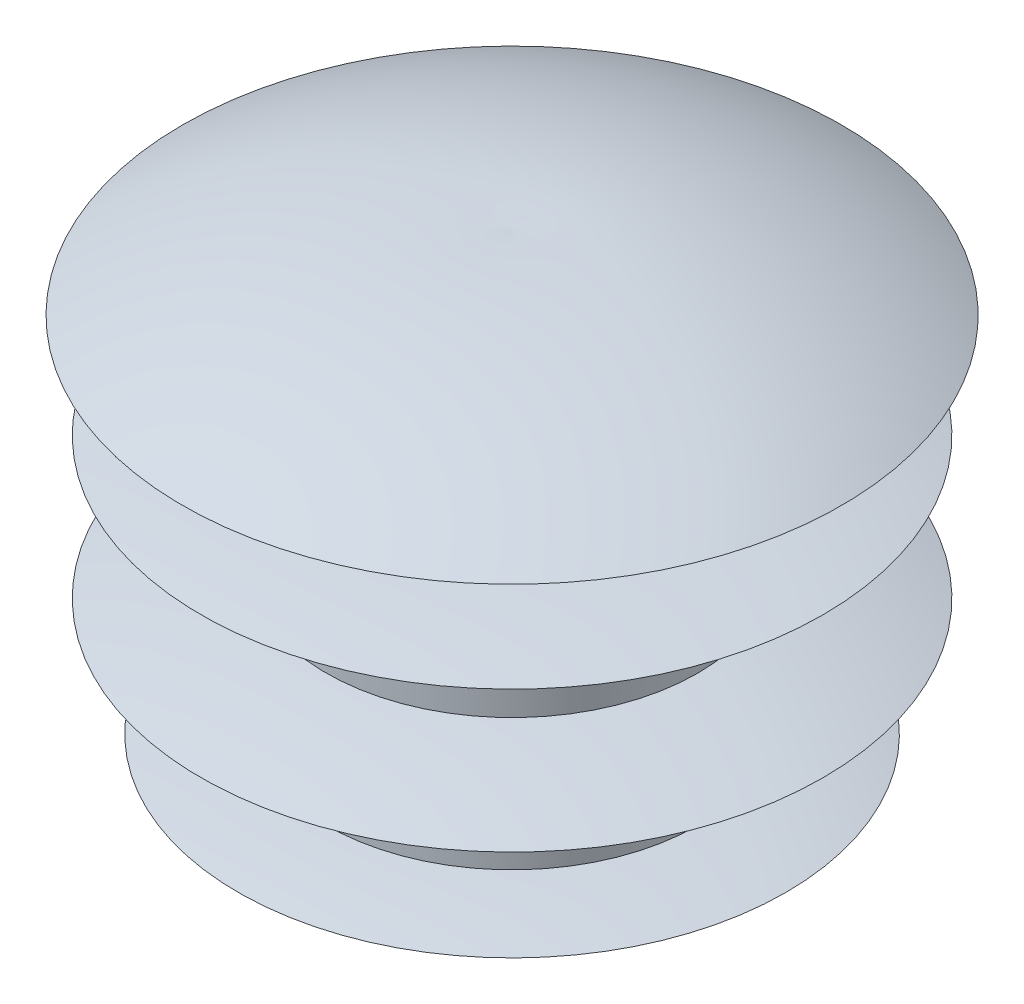
ISO-10303-21;
HEADER;
FILE_DESCRIPTION(('STEP AP214'),'2;1');
FILE_NAME('part.step','',(''),(''),'','','');
FILE_SCHEMA(('AUTOMOTIVE_DESIGN { 1 0 10303 214 1 1 1 1 }'));
ENDSEC;
DATA;
#1=APPLICATION_CONTEXT('core data for automotive mechanical design processes');
#2=APPLICATION_PROTOCOL_DEFINITION('international standard','automotive_design',2000,#1);
#3=PRODUCT_CONTEXT('',#1,'mechanical');
#4=PRODUCT('Part','Part','',(#3));
#5=PRODUCT_RELATED_PRODUCT_CATEGORY('part','',(#4));
#6=PRODUCT_DEFINITION_FORMATION('','',#4);
#7=PRODUCT_DEFINITION_CONTEXT('part definition',#1,'design');
#8=PRODUCT_DEFINITION('design','',#6,#7);
#9=PRODUCT_DEFINITION_SHAPE('','',#8);
#10=(LENGTH_UNIT() NAMED_UNIT(*) SI_UNIT(.MILLI.,.METRE.));
#11=(NAMED_UNIT(*) PLANE_ANGLE_UNIT() SI_UNIT($,.RADIAN.));
#12=(NAMED_UNIT(*) SI_UNIT($,.STERADIAN.) SOLID_ANGLE_UNIT());
#13=UNCERTAINTY_MEASURE_WITH_UNIT(LENGTH_MEASURE(1.E-05),#10,'distance_accuracy_value','');
#14=(GEOMETRIC_REPRESENTATION_CONTEXT(3) GLOBAL_UNCERTAINTY_ASSIGNED_CONTEXT((#13)) GLOBAL_UNIT_ASSIGNED_CONTEXT((#10,
#11,#12)) REPRESENTATION_CONTEXT('',''));
#15=CARTESIAN_POINT('',(0.,0.,0.));
#16=DIRECTION('',(0.,0.,1.));
#17=DIRECTION('',(1.,0.,0.));
#18=AXIS2_PLACEMENT_3D('',#15,#16,#17);
#19=CARTESIAN_POINT('',(-0.952722287189289,-16.4637011005975,0.));
#20=DIRECTION('',(0.,0.,-1.));
#21=DIRECTION('',(-1.,0.,0.));
#22=AXIS2_PLACEMENT_3D('',#19,#20,#21);
#23=CIRCLE('',#22,16.4912441521652);
#24=TRIMMED_CURVE('',#23,(PARAMETER_VALUE(-1.62859991233516)),
(PARAMETER_VALUE(1.62859991233516)),.T.,.PARAMETER.);
#25=CARTESIAN_POINT('',(0.,-16.4637011005975,0.));
#26=DIRECTION('',(0.,1.,0.));
#27=AXIS1_PLACEMENT('',#25,#26);
#28=SURFACE_OF_REVOLUTION('',#24,#27);
#29=CARTESIAN_POINT('',(0.,0.,0.));
#30=VERTEX_POINT('',#29);
#31=VERTEX_LOOP('',#30);
#32=FACE_BOUND('',#31,.T.);
#33=CARTESIAN_POINT('',(0.,-2.,0.));
#34=DIRECTION('',(0.,1.,0.));
#35=DIRECTION('',(-1.,0.,0.));
#36=AXIS2_PLACEMENT_3D('',#33,#34,#35);
#37=CIRCLE('',#36,8.875);
#38=CARTESIAN_POINT('',(-8.875,-2.00000000000001,0.));
#39=VERTEX_POINT('',#38);
#40=EDGE_CURVE('E19',#39,#39,#37,.F.);
#41=ORIENTED_EDGE('',*,*,#40,.F.);
#42=EDGE_LOOP('',(#41));
#43=FACE_BOUND('',#42,.T.);
#44=ADVANCED_FACE('F15',(#32,#43),#28,.T.);
#45=CARTESIAN_POINT('',(6.9375,-2.,0.));
#46=DIRECTION('',(0.,-1.,0.));
#47=DIRECTION('',(0.,0.,-1.));
#48=AXIS2_PLACEMENT_3D('',#45,#46,#47);
#49=PLANE('',#48);
#50=CARTESIAN_POINT('',(0.,-2.,0.));
#51=DIRECTION('',(0.,-1.,0.));
#52=DIRECTION('',(1.,0.,0.));
#53=AXIS2_PLACEMENT_3D('',#50,#51,#52);
#54=CIRCLE('',#53,5.);
#55=CARTESIAN_POINT('',(5.,-2.,0.));
#56=VERTEX_POINT('',#55);
#57=EDGE_CURVE('E34',#56,#56,#54,.T.);
#58=ORIENTED_EDGE('',*,*,#57,.F.);
#59=EDGE_LOOP('',(#58));
#60=FACE_BOUND('',#59,.T.);
#61=ORIENTED_EDGE('',*,*,#40,.T.);
#62=EDGE_LOOP('',(#61));
#63=FACE_BOUND('',#62,.T.);
#64=ADVANCED_FACE('F29',(#60,#63),#49,.T.);
#65=CARTESIAN_POINT('',(0.,-3.15,0.));
#66=DIRECTION('',(0.,-1.,0.));
#67=DIRECTION('',(1.,0.,0.));
#68=AXIS2_PLACEMENT_3D('',#65,#66,#67);
#69=CYLINDRICAL_SURFACE('',#68,5.);
#70=ORIENTED_EDGE('',*,*,#57,.T.);
#71=EDGE_LOOP('',(#70));
#72=FACE_BOUND('',#71,.T.);
#73=CARTESIAN_POINT('',(0.,-4.30000000000001,0.));
#74=DIRECTION('',(0.,-1.,0.));
#75=DIRECTION('',(0.,0.,-1.));
#76=AXIS2_PLACEMENT_3D('',#73,#74,#75);
#77=CIRCLE('',#76,5.);
#78=CARTESIAN_POINT('',(0.,-4.30000000000001,-5.));
#79=VERTEX_POINT('',#78);
#80=EDGE_CURVE('E36',#79,#79,#77,.T.);
#81=ORIENTED_EDGE('',*,*,#80,.F.);
#82=EDGE_LOOP('',(#81));
#83=FACE_BOUND('',#82,.T.);
#84=ADVANCED_FACE('F131',(#72,#83),#69,.T.);
#85=CARTESIAN_POINT('',(0.,-27.1876553346766,0.));
#86=DIRECTION('',(0.,1.,0.));
#87=DIRECTION('',(-1.,0.,0.));
#88=AXIS2_PLACEMENT_3D('',#85,#86,#87);
#89=DEGENERATE_TOROIDAL_SURFACE('',#88,3.33377328375161,22.9482260357722,.T.);
#90=ORIENTED_EDGE('',*,*,#80,.T.);
#91=EDGE_LOOP('',(#90));
#92=FACE_BOUND('',#91,.T.);
#93=CARTESIAN_POINT('',(0.,-4.8,0.));
#94=DIRECTION('',(0.,-1.,0.));
#95=DIRECTION('',(1.,0.,0.));
#96=AXIS2_PLACEMENT_3D('',#93,#94,#95);
#97=CIRCLE('',#96,8.37500000000001);
#98=CARTESIAN_POINT('',(8.37500000000001,-4.8,0.));
#99=VERTEX_POINT('',#98);
#100=EDGE_CURVE('E40',#99,#99,#97,.T.);
#101=ORIENTED_EDGE('',*,*,#100,.F.);
#102=EDGE_LOOP('',(#101));
#103=FACE_BOUND('',#102,.T.);
#104=ADVANCED_FACE('F134',(#92,#103),#89,.T.);
#105=CARTESIAN_POINT('',(0.,15.7019594484907,0.));
#106=DIRECTION('',(0.,1.,0.));
#107=DIRECTION('',(-1.,0.,0.));
#108=AXIS2_PLACEMENT_3D('',#105,#106,#107);
#109=DEGENERATE_TOROIDAL_SURFACE('',#108,2.04817567811316,21.4559792884775,.T.);
#110=ORIENTED_EDGE('',*,*,#100,.T.);
#111=EDGE_LOOP('',(#110));
#112=FACE_BOUND('',#111,.T.);
#113=CARTESIAN_POINT('',(0.,-5.55,0.));
#114=DIRECTION('',(0.,-1.,0.));
#115=DIRECTION('',(1.,0.,0.));
#116=AXIS2_PLACEMENT_3D('',#113,#114,#115);
#117=CIRCLE('',#116,5.);
#118=CARTESIAN_POINT('',(5.,-5.55,0.));
#119=VERTEX_POINT('',#118);
#120=EDGE_CURVE('E55',#119,#119,#117,.T.);
#121=ORIENTED_EDGE('',*,*,#120,.F.);
#122=EDGE_LOOP('',(#121));
#123=FACE_BOUND('',#122,.T.);
#124=ADVANCED_FACE('F129',(#112,#123),#109,.T.);
#125=CARTESIAN_POINT('',(0.,-6.7,0.));
#126=DIRECTION('',(0.,-1.,0.));
#127=DIRECTION('',(1.,0.,0.));
#128=AXIS2_PLACEMENT_3D('',#125,#126,#127);
#129=CYLINDRICAL_SURFACE('',#128,5.);
#130=ORIENTED_EDGE('',*,*,#120,.T.);
#131=EDGE_LOOP('',(#130));
#132=FACE_BOUND('',#131,.T.);
#133=CARTESIAN_POINT('',(0.,-7.85,0.));
#134=DIRECTION('',(0.,-1.,0.));
#135=DIRECTION('',(1.,0.,0.));
#136=AXIS2_PLACEMENT_3D('',#133,#134,#135);
#137=CIRCLE('',#136,5.00000000000002);
#138=CARTESIAN_POINT('',(5.00000000000002,-7.85,0.));
#139=VERTEX_POINT('',#138);
#140=EDGE_CURVE('E60',#139,#139,#137,.T.);
#141=ORIENTED_EDGE('',*,*,#140,.F.);
#142=EDGE_LOOP('',(#141));
#143=FACE_BOUND('',#142,.T.);
#144=ADVANCED_FACE('F125',(#132,#143),#129,.T.);
#145=CARTESIAN_POINT('',(0.,-29.1019594484907,0.));
#146=DIRECTION('',(0.,1.,0.));
#147=DIRECTION('',(-1.,0.,0.));
#148=AXIS2_PLACEMENT_3D('',#145,#146,#147);
#149=DEGENERATE_TOROIDAL_SURFACE('',#148,2.04817567811318,21.4559792884775,.T.);
#150=ORIENTED_EDGE('',*,*,#140,.T.);
#151=EDGE_LOOP('',(#150));
#152=FACE_BOUND('',#151,.T.);
#153=CARTESIAN_POINT('',(0.,-8.59999999999999,0.));
#154=DIRECTION('',(0.,-1.,0.));
#155=DIRECTION('',(1.,0.,0.));
#156=AXIS2_PLACEMENT_3D('',#153,#154,#155);
#157=CIRCLE('',#156,8.37499999999998);
#158=CARTESIAN_POINT('',(8.37499999999998,-8.59999999999999,0.));
#159=VERTEX_POINT('',#158);
#160=EDGE_CURVE('E65',#159,#159,#157,.T.);
#161=ORIENTED_EDGE('',*,*,#160,.F.);
#162=EDGE_LOOP('',(#161));
#163=FACE_BOUND('',#162,.T.);
#164=ADVANCED_FACE('F128',(#152,#163),#149,.T.);
#165=CARTESIAN_POINT('',(0.,13.7876553346766,0.));
#166=DIRECTION('',(0.,1.,0.));
#167=DIRECTION('',(-1.,0.,0.));
#168=AXIS2_PLACEMENT_3D('',#165,#166,#167);
#169=DEGENERATE_TOROIDAL_SURFACE('',#168,3.33377328375161,22.9482260357722,.T.);
#170=ORIENTED_EDGE('',*,*,#160,.T.);
#171=EDGE_LOOP('',(#170));
#172=FACE_BOUND('',#171,.T.);
#173=CARTESIAN_POINT('',(0.,-9.1,0.));
#174=DIRECTION('',(0.,-1.,0.));
#175=DIRECTION('',(1.,0.,0.));
#176=AXIS2_PLACEMENT_3D('',#173,#174,#175);
#177=CIRCLE('',#176,5.);
#178=CARTESIAN_POINT('',(5.,-9.1,0.));
#179=VERTEX_POINT('',#178);
#180=EDGE_CURVE('E70',#179,#179,#177,.T.);
#181=ORIENTED_EDGE('',*,*,#180,.F.);
#182=EDGE_LOOP('',(#181));
#183=FACE_BOUND('',#182,.T.);
#184=ADVANCED_FACE('F123',(#172,#183),#169,.T.);
#185=CARTESIAN_POINT('',(0.,-10.25,0.));
#186=DIRECTION('',(0.,-1.,0.));
#187=DIRECTION('',(1.,0.,0.));
#188=AXIS2_PLACEMENT_3D('',#185,#186,#187);
#189=CYLINDRICAL_SURFACE('',#188,5.);
#190=ORIENTED_EDGE('',*,*,#180,.T.);
#191=EDGE_LOOP('',(#190));
#192=FACE_BOUND('',#191,.T.);
#193=CARTESIAN_POINT('',(0.,-11.4,0.));
#194=DIRECTION('',(0.,-1.,0.));
#195=DIRECTION('',(1.,0.,0.));
#196=AXIS2_PLACEMENT_3D('',#193,#194,#195);
#197=CIRCLE('',#196,5.00000000000002);
#198=CARTESIAN_POINT('',(5.00000000000002,-11.4,0.));
#199=VERTEX_POINT('',#198);
#200=EDGE_CURVE('E75',#199,#199,#197,.T.);
#201=ORIENTED_EDGE('',*,*,#200,.F.);
#202=EDGE_LOOP('',(#201));
#203=FACE_BOUND('',#202,.T.);
#204=ADVANCED_FACE('F103',(#192,#203),#189,.T.);
#205=CARTESIAN_POINT('',(0.,-29.2836529544734,0.));
#206=DIRECTION('',(0.,1.,0.));
#207=DIRECTION('',(-1.,0.,0.));
#208=AXIS2_PLACEMENT_3D('',#205,#206,#207);
#209=DEGENERATE_TOROIDAL_SURFACE('',#208,3.39337058613575,17.9556760126023,.T.);
#210=ORIENTED_EDGE('',*,*,#200,.T.);
#211=EDGE_LOOP('',(#210));
#212=FACE_BOUND('',#211,.T.);
#213=CARTESIAN_POINT('',(0.,-11.775,0.));
#214=DIRECTION('',(0.,-1.,0.));
#215=DIRECTION('',(1.,0.,0.));
#216=AXIS2_PLACEMENT_3D('',#213,#214,#215);
#217=CIRCLE('',#216,7.375);
#218=CARTESIAN_POINT('',(7.375,-11.775,0.));
#219=VERTEX_POINT('',#218);
#220=EDGE_CURVE('E80',#219,#219,#217,.T.);
#221=ORIENTED_EDGE('',*,*,#220,.F.);
#222=EDGE_LOOP('',(#221));
#223=FACE_BOUND('',#222,.T.);
#224=ADVANCED_FACE('F94',(#212,#223),#209,.T.);
#225=CARTESIAN_POINT('',(0.,9.19487891317613,0.));
#226=DIRECTION('',(0.,1.,0.));
#227=DIRECTION('',(-1.,0.,0.));
#228=AXIS2_PLACEMENT_3D('',#225,#226,#227);
#229=DEGENERATE_TOROIDAL_SURFACE('',#228,0.586873970216786,22.0411995279179,.T.);
#230=ORIENTED_EDGE('',*,*,#220,.T.);
#231=EDGE_LOOP('',(#230));
#232=FACE_BOUND('',#231,.T.);
#233=CARTESIAN_POINT('',(0.,-12.4,0.));
#234=DIRECTION('',(0.,-1.,0.));
#235=DIRECTION('',(1.,0.,0.));
#236=AXIS2_PLACEMENT_3D('',#233,#234,#235);
#237=CIRCLE('',#236,5.);
#238=CARTESIAN_POINT('',(5.,-12.4,0.));
#239=VERTEX_POINT('',#238);
#240=EDGE_CURVE('E46',#239,#239,#237,.T.);
#241=ORIENTED_EDGE('',*,*,#240,.F.);
#242=EDGE_LOOP('',(#241));
#243=FACE_BOUND('',#242,.T.);
#244=ADVANCED_FACE('F17',(#232,#243),#229,.T.);
#245=CARTESIAN_POINT('',(0.,-12.45,0.));
#246=DIRECTION('',(0.,-1.,0.));
#247=DIRECTION('',(1.,0.,0.));
#248=AXIS2_PLACEMENT_3D('',#245,#246,#247);
#249=CYLINDRICAL_SURFACE('',#248,5.);
#250=ORIENTED_EDGE('',*,*,#240,.T.);
#251=EDGE_LOOP('',(#250));
#252=FACE_BOUND('',#251,.T.);
#253=CARTESIAN_POINT('',(0.,-12.5,0.));
#254=DIRECTION('',(0.,-1.,0.));
#255=DIRECTION('',(1.,0.,0.));
#256=AXIS2_PLACEMENT_3D('',#253,#254,#255);
#257=CIRCLE('',#256,5.);
#258=CARTESIAN_POINT('',(5.,-12.5,0.));
#259=VERTEX_POINT('',#258);
#260=EDGE_CURVE('E43',#259,#259,#257,.T.);
#261=ORIENTED_EDGE('',*,*,#260,.F.);
#262=EDGE_LOOP('',(#261));
#263=FACE_BOUND('',#262,.T.);
#264=ADVANCED_FACE('F90',(#252,#263),#249,.T.);
#265=CARTESIAN_POINT('',(0.,-1.1,0.));
#266=DIRECTION('',(0.,1.,0.));
#267=DIRECTION('',(0.,0.,1.));
#268=AXIS2_PLACEMENT_3D('',#265,#266,#267);
#269=PLANE('',#268);
#270=CARTESIAN_POINT('',(0.,-1.1,0.));
#271=DIRECTION('',(0.,1.,0.));
#272=DIRECTION('',(-1.,0.,0.));
#273=AXIS2_PLACEMENT_3D('',#270,#271,#272);
#274=CIRCLE('',#273,3.875);
#275=CARTESIAN_POINT('',(-3.875,-1.1,0.));
#276=VERTEX_POINT('',#275);
#277=EDGE_CURVE('E23',#276,#276,#274,.F.);
#278=ORIENTED_EDGE('',*,*,#277,.T.);
#279=EDGE_LOOP('',(#278));
#280=FACE_BOUND('',#279,.T.);
#281=ADVANCED_FACE('F101',(#280),#269,.F.);
#282=CARTESIAN_POINT('',(2.5,-12.5,0.));
#283=DIRECTION('',(0.,-1.,0.));
#284=DIRECTION('',(0.,0.,-1.));
#285=AXIS2_PLACEMENT_3D('',#282,#283,#284);
#286=PLANE('',#285);
#287=CARTESIAN_POINT('',(0.,-12.5,0.));
#288=DIRECTION('',(0.,1.,0.));
#289=DIRECTION('',(-1.,0.,0.));
#290=AXIS2_PLACEMENT_3D('',#287,#288,#289);
#291=CIRCLE('',#290,3.875);
#292=CARTESIAN_POINT('',(-3.87499999999999,-12.5,0.));
#293=VERTEX_POINT('',#292);
#294=EDGE_CURVE('E10',#293,#293,#291,.T.);
#295=ORIENTED_EDGE('',*,*,#294,.T.);
#296=EDGE_LOOP('',(#295));
#297=FACE_BOUND('',#296,.T.);
#298=ORIENTED_EDGE('',*,*,#260,.T.);
#299=EDGE_LOOP('',(#298));
#300=FACE_BOUND('',#299,.T.);
#301=ADVANCED_FACE('F107',(#297,#300),#286,.T.);
#302=CARTESIAN_POINT('',(0.,-12.5,0.));
#303=DIRECTION('',(0.,1.,0.));
#304=DIRECTION('',(-1.,0.,0.));
#305=AXIS2_PLACEMENT_3D('',#302,#303,#304);
#306=CYLINDRICAL_SURFACE('',#305,3.875);
#307=ORIENTED_EDGE('',*,*,#294,.F.);
#308=EDGE_LOOP('',(#307));
#309=FACE_BOUND('',#308,.T.);
#310=ORIENTED_EDGE('',*,*,#277,.F.);
#311=EDGE_LOOP('',(#310));
#312=FACE_BOUND('',#311,.T.);
#313=ADVANCED_FACE('F105',(#309,#312),#306,.F.);
#314=CLOSED_SHELL('',(#44,#64,#84,#104,#124,#144,#164,#184,#204,#224,#244,#264,#281,#301,#313));
#315=MANIFOLD_SOLID_BREP('B1',#314);
#316=ADVANCED_BREP_SHAPE_REPRESENTATION('',(#18,#315),#14);
#317=SHAPE_DEFINITION_REPRESENTATION(#9,#316);
ENDSEC;
END-ISO-10303-21;
